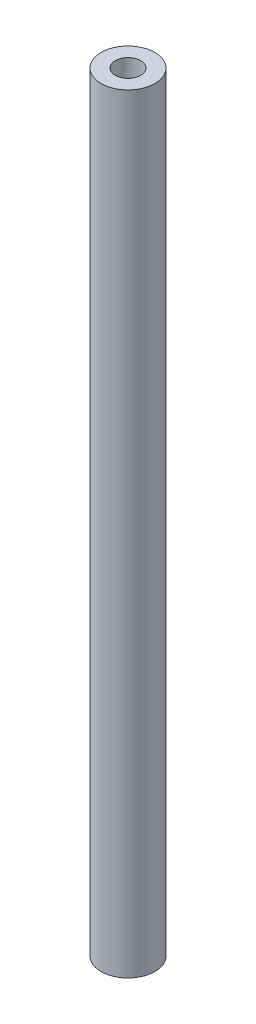
ISO-10303-21;
HEADER;
FILE_DESCRIPTION(('STEP AP214'),'2;1');
FILE_NAME('part.step','',(''),(''),'','','');
FILE_SCHEMA(('AUTOMOTIVE_DESIGN { 1 0 10303 214 1 1 1 1 }'));
ENDSEC;
DATA;
#1=APPLICATION_CONTEXT('core data for automotive mechanical design processes');
#2=APPLICATION_PROTOCOL_DEFINITION('international standard','automotive_design',2000,#1);
#3=PRODUCT_CONTEXT('',#1,'mechanical');
#4=PRODUCT('Part','Part','',(#3));
#5=PRODUCT_RELATED_PRODUCT_CATEGORY('part','',(#4));
#6=PRODUCT_DEFINITION_FORMATION('','',#4);
#7=PRODUCT_DEFINITION_CONTEXT('part definition',#1,'design');
#8=PRODUCT_DEFINITION('design','',#6,#7);
#9=PRODUCT_DEFINITION_SHAPE('','',#8);
#10=(LENGTH_UNIT() NAMED_UNIT(*) SI_UNIT(.MILLI.,.METRE.));
#11=(NAMED_UNIT(*) PLANE_ANGLE_UNIT() SI_UNIT($,.RADIAN.));
#12=(NAMED_UNIT(*) SI_UNIT($,.STERADIAN.) SOLID_ANGLE_UNIT());
#13=UNCERTAINTY_MEASURE_WITH_UNIT(LENGTH_MEASURE(1.E-05),#10,'distance_accuracy_value','');
#14=(GEOMETRIC_REPRESENTATION_CONTEXT(3) GLOBAL_UNCERTAINTY_ASSIGNED_CONTEXT((#13)) GLOBAL_UNIT_ASSIGNED_CONTEXT((#10,
#11,#12)) REPRESENTATION_CONTEXT('',''));
#15=CARTESIAN_POINT('',(0.,0.,0.));
#16=DIRECTION('',(0.,0.,1.));
#17=DIRECTION('',(1.,0.,0.));
#18=AXIS2_PLACEMENT_3D('',#15,#16,#17);
#19=CARTESIAN_POINT('',(0.,300.,0.));
#20=DIRECTION('',(0.,1.,0.));
#21=DIRECTION('',(0.,0.,1.));
#22=AXIS2_PLACEMENT_3D('',#19,#20,#21);
#23=PLANE('',#22);
#24=CARTESIAN_POINT('',(0.,300.,0.));
#25=DIRECTION('',(0.,1.,0.));
#26=DIRECTION('',(0.,0.,1.));
#27=AXIS2_PLACEMENT_3D('',#24,#25,#26);
#28=CIRCLE('',#27,10.5);
#29=CARTESIAN_POINT('',(0.,300.,10.5));
#30=VERTEX_POINT('',#29);
#31=EDGE_CURVE('E10',#30,#30,#28,.T.);
#32=ORIENTED_EDGE('',*,*,#31,.T.);
#33=EDGE_LOOP('',(#32));
#34=FACE_BOUND('',#33,.T.);
#35=CARTESIAN_POINT('',(0.,300.,0.));
#36=DIRECTION('',(0.,1.,0.));
#37=DIRECTION('',(0.,0.,1.));
#38=AXIS2_PLACEMENT_3D('',#35,#36,#37);
#39=CIRCLE('',#38,4.96379009091205);
#40=CARTESIAN_POINT('',(0.,300.,4.96379009091205));
#41=VERTEX_POINT('',#40);
#42=EDGE_CURVE('E45',#41,#41,#39,.T.);
#43=ORIENTED_EDGE('',*,*,#42,.F.);
#44=EDGE_LOOP('',(#43));
#45=FACE_BOUND('',#44,.T.);
#46=ADVANCED_FACE('F34',(#34,#45),#23,.T.);
#47=CARTESIAN_POINT('',(0.,0.,0.));
#48=DIRECTION('',(0.,1.,0.));
#49=DIRECTION('',(0.,0.,1.));
#50=AXIS2_PLACEMENT_3D('',#47,#48,#49);
#51=PLANE('',#50);
#52=CARTESIAN_POINT('',(0.,0.,0.));
#53=DIRECTION('',(0.,1.,0.));
#54=DIRECTION('',(0.,0.,1.));
#55=AXIS2_PLACEMENT_3D('',#52,#53,#54);
#56=CIRCLE('',#55,10.5);
#57=CARTESIAN_POINT('',(0.,0.,10.5));
#58=VERTEX_POINT('',#57);
#59=EDGE_CURVE('E38',#58,#58,#56,.T.);
#60=ORIENTED_EDGE('',*,*,#59,.F.);
#61=EDGE_LOOP('',(#60));
#62=FACE_BOUND('',#61,.T.);
#63=CARTESIAN_POINT('',(0.,0.,0.));
#64=DIRECTION('',(0.,1.,0.));
#65=DIRECTION('',(0.,0.,1.));
#66=AXIS2_PLACEMENT_3D('',#63,#64,#65);
#67=CIRCLE('',#66,4.96379009091205);
#68=CARTESIAN_POINT('',(0.,0.,4.96379009091205));
#69=VERTEX_POINT('',#68);
#70=EDGE_CURVE('E47',#69,#69,#67,.T.);
#71=ORIENTED_EDGE('',*,*,#70,.T.);
#72=EDGE_LOOP('',(#71));
#73=FACE_BOUND('',#72,.T.);
#74=ADVANCED_FACE('F57',(#62,#73),#51,.F.);
#75=CARTESIAN_POINT('',(0.,300.,0.));
#76=DIRECTION('',(0.,-1.,0.));
#77=DIRECTION('',(0.,0.,-1.));
#78=AXIS2_PLACEMENT_3D('',#75,#76,#77);
#79=CYLINDRICAL_SURFACE('',#78,10.5);
#80=ORIENTED_EDGE('',*,*,#31,.F.);
#81=EDGE_LOOP('',(#80));
#82=FACE_BOUND('',#81,.T.);
#83=ORIENTED_EDGE('',*,*,#59,.T.);
#84=EDGE_LOOP('',(#83));
#85=FACE_BOUND('',#84,.T.);
#86=ADVANCED_FACE('F36',(#82,#85),#79,.T.);
#87=CARTESIAN_POINT('',(0.,300.,0.));
#88=DIRECTION('',(0.,-1.,0.));
#89=DIRECTION('',(0.,0.,-1.));
#90=AXIS2_PLACEMENT_3D('',#87,#88,#89);
#91=CYLINDRICAL_SURFACE('',#90,4.96379009091205);
#92=ORIENTED_EDGE('',*,*,#42,.T.);
#93=EDGE_LOOP('',(#92));
#94=FACE_BOUND('',#93,.T.);
#95=ORIENTED_EDGE('',*,*,#70,.F.);
#96=EDGE_LOOP('',(#95));
#97=FACE_BOUND('',#96,.T.);
#98=ADVANCED_FACE('F53',(#94,#97),#91,.F.);
#99=CLOSED_SHELL('',(#46,#74,#86,#98));
#100=MANIFOLD_SOLID_BREP('B2',#99);
#101=ADVANCED_BREP_SHAPE_REPRESENTATION('',(#18,#100),#14);
#102=SHAPE_DEFINITION_REPRESENTATION(#9,#101);
ENDSEC;
END-ISO-10303-21;
